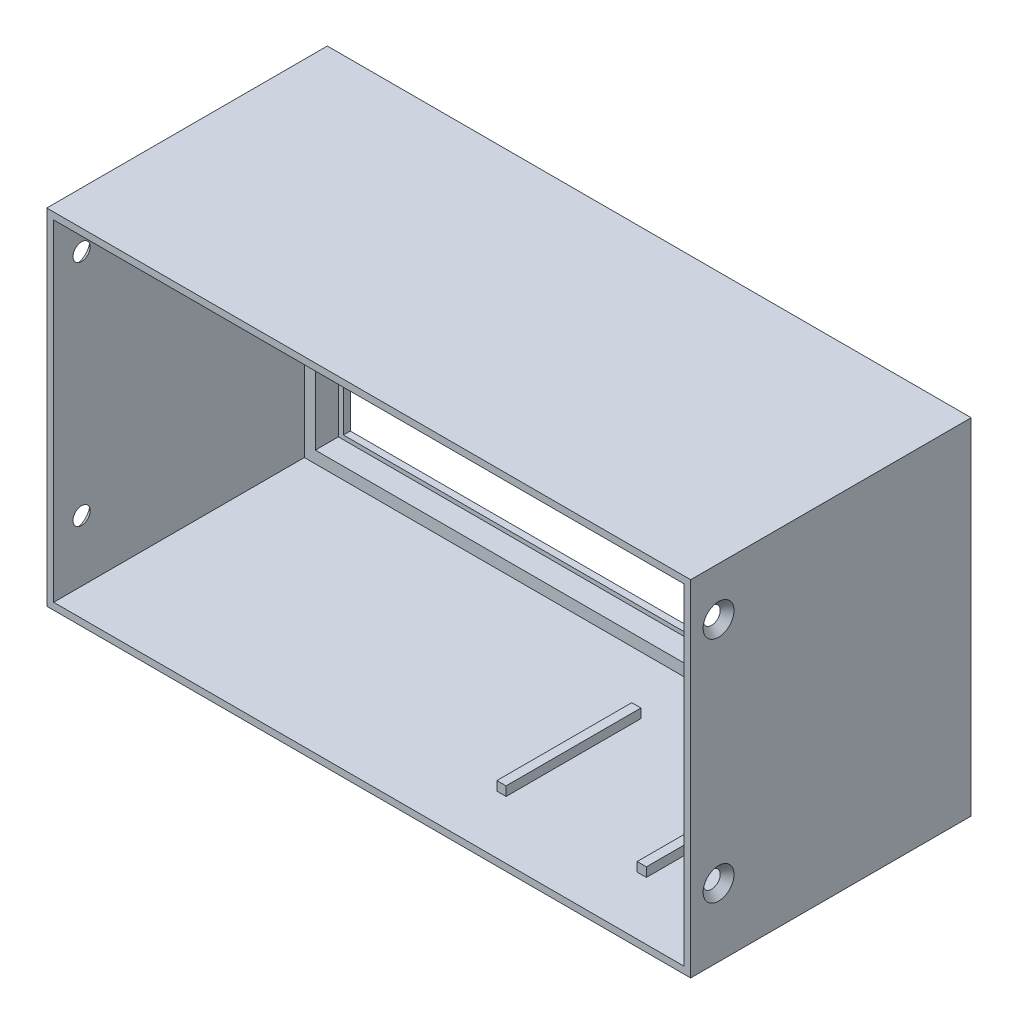
ISO-10303-21;
HEADER;
FILE_DESCRIPTION(('STEP AP214'),'2;1');
FILE_NAME('part.step','',(''),(''),'','','');
FILE_SCHEMA(('AUTOMOTIVE_DESIGN { 1 0 10303 214 1 1 1 1 }'));
ENDSEC;
DATA;
#1=APPLICATION_CONTEXT('core data for automotive mechanical design processes');
#2=APPLICATION_PROTOCOL_DEFINITION('international standard','automotive_design',2000,#1);
#3=PRODUCT_CONTEXT('',#1,'mechanical');
#4=PRODUCT('Part','Part','',(#3));
#5=PRODUCT_RELATED_PRODUCT_CATEGORY('part','',(#4));
#6=PRODUCT_DEFINITION_FORMATION('','',#4);
#7=PRODUCT_DEFINITION_CONTEXT('part definition',#1,'design');
#8=PRODUCT_DEFINITION('design','',#6,#7);
#9=PRODUCT_DEFINITION_SHAPE('','',#8);
#10=(LENGTH_UNIT() NAMED_UNIT(*) SI_UNIT(.MILLI.,.METRE.));
#11=(NAMED_UNIT(*) PLANE_ANGLE_UNIT() SI_UNIT($,.RADIAN.));
#12=(NAMED_UNIT(*) SI_UNIT($,.STERADIAN.) SOLID_ANGLE_UNIT());
#13=UNCERTAINTY_MEASURE_WITH_UNIT(LENGTH_MEASURE(1.E-05),#10,'distance_accuracy_value','');
#14=(GEOMETRIC_REPRESENTATION_CONTEXT(3) GLOBAL_UNCERTAINTY_ASSIGNED_CONTEXT((#13)) GLOBAL_UNIT_ASSIGNED_CONTEXT((#10,
#11,#12)) REPRESENTATION_CONTEXT('',''));
#15=CARTESIAN_POINT('',(0.,0.,0.));
#16=DIRECTION('',(0.,0.,1.));
#17=DIRECTION('',(1.,0.,0.));
#18=AXIS2_PLACEMENT_3D('',#15,#16,#17);
#19=CARTESIAN_POINT('',(-50.7518115942029,-41.4121376811594,61.));
#20=DIRECTION('',(0.,1.,0.));
#21=DIRECTION('',(0.,0.,1.));
#22=AXIS2_PLACEMENT_3D('',#19,#20,#21);
#23=PLANE('',#22);
#24=DIRECTION('',(0.,0.,-1.));
#25=VECTOR('',#24,1.);
#26=CARTESIAN_POINT('',(87.7481884057971,-41.4121376811594,61.));
#27=LINE('',#26,#25);
#28=CARTESIAN_POINT('',(87.7481884057971,-41.4121376811594,61.));
#29=VERTEX_POINT('',#28);
#30=CARTESIAN_POINT('',(87.7481884057971,-41.4121376811594,6.5));
#31=VERTEX_POINT('',#30);
#32=EDGE_CURVE('E348',#29,#31,#27,.T.);
#33=ORIENTED_EDGE('',*,*,#32,.T.);
#34=DIRECTION('',(1.,0.,0.));
#35=VECTOR('',#34,1.);
#36=CARTESIAN_POINT('',(-49.2518115942029,-41.4121376811594,6.5));
#37=LINE('',#36,#35);
#38=CARTESIAN_POINT('',(-49.2518115942029,-41.4121376811594,6.5));
#39=VERTEX_POINT('',#38);
#40=EDGE_CURVE('E316',#39,#31,#37,.T.);
#41=ORIENTED_EDGE('',*,*,#40,.F.);
#42=DIRECTION('',(0.,0.,-1.));
#43=VECTOR('',#42,1.);
#44=CARTESIAN_POINT('',(-49.2518115942029,-41.4121376811594,61.));
#45=LINE('',#44,#43);
#46=CARTESIAN_POINT('',(-49.2518115942029,-41.4121376811594,61.));
#47=VERTEX_POINT('',#46);
#48=EDGE_CURVE('E344',#47,#39,#45,.T.);
#49=ORIENTED_EDGE('',*,*,#48,.F.);
#50=DIRECTION('',(1.,0.,0.));
#51=VECTOR('',#50,1.);
#52=CARTESIAN_POINT('',(-50.7518115942029,-41.4121376811594,61.));
#53=LINE('',#52,#51);
#54=EDGE_CURVE('E359',#47,#29,#53,.T.);
#55=ORIENTED_EDGE('',*,*,#54,.T.);
#56=EDGE_LOOP('',(#33,#41,#49,#55));
#57=FACE_BOUND('',#56,.T.);
#58=DIRECTION('',(1.,0.,0.));
#59=VECTOR('',#58,1.);
#60=CARTESIAN_POINT('',(0.,-41.4121376811594,48.3824443702474));
#61=LINE('',#60,#59);
#62=CARTESIAN_POINT('',(34.5,-41.4121376811594,48.3824443702474));
#63=VERTEX_POINT('',#62);
#64=CARTESIAN_POINT('',(36.5,-41.4121376811594,48.3824443702474));
#65=VERTEX_POINT('',#64);
#66=EDGE_CURVE('E226',#63,#65,#61,.T.);
#67=ORIENTED_EDGE('',*,*,#66,.F.);
#68=DIRECTION('',(0.,0.,1.));
#69=VECTOR('',#68,1.);
#70=CARTESIAN_POINT('',(34.5,-41.4121376811594,0.));
#71=LINE('',#70,#69);
#72=CARTESIAN_POINT('',(34.5,-41.4121376811594,19.0628968793476));
#73=VERTEX_POINT('',#72);
#74=EDGE_CURVE('E223',#73,#63,#71,.T.);
#75=ORIENTED_EDGE('',*,*,#74,.F.);
#76=DIRECTION('',(1.,0.,0.));
#77=VECTOR('',#76,1.);
#78=CARTESIAN_POINT('',(0.,-41.4121376811594,19.0628968793476));
#79=LINE('',#78,#77);
#80=CARTESIAN_POINT('',(36.5,-41.4121376811594,19.0628968793476));
#81=VERTEX_POINT('',#80);
#82=EDGE_CURVE('E236',#73,#81,#79,.T.);
#83=ORIENTED_EDGE('',*,*,#82,.T.);
#84=DIRECTION('',(0.,0.,1.));
#85=VECTOR('',#84,1.);
#86=CARTESIAN_POINT('',(36.5,-41.4121376811594,0.));
#87=LINE('',#86,#85);
#88=EDGE_CURVE('E247',#81,#65,#87,.T.);
#89=ORIENTED_EDGE('',*,*,#88,.T.);
#90=EDGE_LOOP('',(#67,#75,#83,#89));
#91=FACE_BOUND('',#90,.T.);
#92=DIRECTION('',(1.,0.,0.));
#93=VECTOR('',#92,1.);
#94=CARTESIAN_POINT('',(0.,-41.4121376811594,48.3824443702474));
#95=LINE('',#94,#93);
#96=CARTESIAN_POINT('',(65.,-41.4121376811594,48.3824443702474));
#97=VERTEX_POINT('',#96);
#98=CARTESIAN_POINT('',(67.,-41.4121376811594,48.3824443702474));
#99=VERTEX_POINT('',#98);
#100=EDGE_CURVE('E56',#97,#99,#95,.T.);
#101=ORIENTED_EDGE('',*,*,#100,.F.);
#102=DIRECTION('',(0.,0.,1.));
#103=VECTOR('',#102,1.);
#104=CARTESIAN_POINT('',(65.,-41.4121376811594,0.));
#105=LINE('',#104,#103);
#106=CARTESIAN_POINT('',(65.,-41.4121376811594,19.0628968793476));
#107=VERTEX_POINT('',#106);
#108=EDGE_CURVE('E222',#107,#97,#105,.T.);
#109=ORIENTED_EDGE('',*,*,#108,.F.);
#110=DIRECTION('',(1.,0.,0.));
#111=VECTOR('',#110,1.);
#112=CARTESIAN_POINT('',(0.,-41.4121376811594,19.0628968793476));
#113=LINE('',#112,#111);
#114=CARTESIAN_POINT('',(67.,-41.4121376811594,19.0628968793476));
#115=VERTEX_POINT('',#114);
#116=EDGE_CURVE('E219',#107,#115,#113,.T.);
#117=ORIENTED_EDGE('',*,*,#116,.T.);
#118=DIRECTION('',(0.,0.,1.));
#119=VECTOR('',#118,1.);
#120=CARTESIAN_POINT('',(67.,-41.4121376811594,0.));
#121=LINE('',#120,#119);
#122=EDGE_CURVE('E61',#115,#99,#121,.T.);
#123=ORIENTED_EDGE('',*,*,#122,.T.);
#124=EDGE_LOOP('',(#101,#109,#117,#123));
#125=FACE_BOUND('',#124,.T.);
#126=ADVANCED_FACE('F41',(#57,#91,#125),#23,.T.);
#127=CARTESIAN_POINT('',(0.,0.,1.5));
#128=DIRECTION('',(0.,0.,1.));
#129=DIRECTION('',(1.,0.,0.));
#130=AXIS2_PLACEMENT_3D('',#127,#128,#129);
#131=PLANE('',#130);
#132=DIRECTION('',(0.,1.,0.));
#133=VECTOR('',#132,1.);
#134=CARTESIAN_POINT('',(84.2481884057971,0.,1.5));
#135=LINE('',#134,#133);
#136=CARTESIAN_POINT('',(84.2481884057971,-37.9121376811594,1.50000000000002));
#137=VERTEX_POINT('',#136);
#138=CARTESIAN_POINT('',(84.2481884057971,27.0878623188406,1.50000000000002));
#139=VERTEX_POINT('',#138);
#140=EDGE_CURVE('E11',#137,#139,#135,.T.);
#141=ORIENTED_EDGE('',*,*,#140,.F.);
#142=DIRECTION('',(1.,0.,0.));
#143=VECTOR('',#142,1.);
#144=CARTESIAN_POINT('',(0.,-37.9121376811594,1.5));
#145=LINE('',#144,#143);
#146=CARTESIAN_POINT('',(-45.7518115942029,-37.9121376811594,1.5));
#147=VERTEX_POINT('',#146);
#148=EDGE_CURVE('E394',#147,#137,#145,.T.);
#149=ORIENTED_EDGE('',*,*,#148,.F.);
#150=DIRECTION('',(0.,-1.,0.));
#151=VECTOR('',#150,1.);
#152=CARTESIAN_POINT('',(-45.7518115942029,0.,1.5));
#153=LINE('',#152,#151);
#154=CARTESIAN_POINT('',(-45.7518115942029,27.0878623188406,1.50000000000002));
#155=VERTEX_POINT('',#154);
#156=EDGE_CURVE('E396',#155,#147,#153,.T.);
#157=ORIENTED_EDGE('',*,*,#156,.F.);
#158=DIRECTION('',(-1.,0.,0.));
#159=VECTOR('',#158,1.);
#160=CARTESIAN_POINT('',(0.,27.0878623188406,1.5));
#161=LINE('',#160,#159);
#162=EDGE_CURVE('E49',#139,#155,#161,.T.);
#163=ORIENTED_EDGE('',*,*,#162,.F.);
#164=EDGE_LOOP('',(#141,#149,#157,#163));
#165=FACE_BOUND('',#164,.T.);
#166=DIRECTION('',(-1.,0.,0.));
#167=VECTOR('',#166,1.);
#168=CARTESIAN_POINT('',(-49.2518115942029,-38.8121376811594,1.5));
#169=LINE('',#168,#167);
#170=CARTESIAN_POINT('',(85.3481884057971,-38.8121376811594,1.5));
#171=VERTEX_POINT('',#170);
#172=CARTESIAN_POINT('',(-46.8518115942029,-38.8121376811594,1.5));
#173=VERTEX_POINT('',#172);
#174=EDGE_CURVE('E309',#171,#173,#169,.T.);
#175=ORIENTED_EDGE('',*,*,#174,.F.);
#176=DIRECTION('',(0.,-1.,0.));
#177=VECTOR('',#176,1.);
#178=CARTESIAN_POINT('',(85.3481884057971,30.5878623188406,1.5));
#179=LINE('',#178,#177);
#180=CARTESIAN_POINT('',(85.3481884057971,27.2878623188406,1.5));
#181=VERTEX_POINT('',#180);
#182=EDGE_CURVE('E289',#181,#171,#179,.T.);
#183=ORIENTED_EDGE('',*,*,#182,.F.);
#184=DIRECTION('',(1.,0.,0.));
#185=VECTOR('',#184,1.);
#186=CARTESIAN_POINT('',(-49.2518115942029,27.2878623188406,1.5));
#187=LINE('',#186,#185);
#188=CARTESIAN_POINT('',(-46.8518115942029,27.2878623188406,1.5));
#189=VERTEX_POINT('',#188);
#190=EDGE_CURVE('E306',#189,#181,#187,.T.);
#191=ORIENTED_EDGE('',*,*,#190,.F.);
#192=DIRECTION('',(0.,1.,0.));
#193=VECTOR('',#192,1.);
#194=CARTESIAN_POINT('',(-46.8518115942029,30.5878623188406,1.5));
#195=LINE('',#194,#193);
#196=EDGE_CURVE('E295',#173,#189,#195,.T.);
#197=ORIENTED_EDGE('',*,*,#196,.F.);
#198=EDGE_LOOP('',(#175,#183,#191,#197));
#199=FACE_BOUND('',#198,.T.);
#200=ADVANCED_FACE('F411',(#165,#199),#131,.T.);
#201=CARTESIAN_POINT('',(-49.2518115942029,-38.8121376811594,6.5));
#202=DIRECTION('',(0.,-1.,0.));
#203=DIRECTION('',(0.,0.,-1.));
#204=AXIS2_PLACEMENT_3D('',#201,#202,#203);
#205=PLANE('',#204);
#206=DIRECTION('',(0.,0.,-1.));
#207=VECTOR('',#206,1.);
#208=CARTESIAN_POINT('',(85.3481884057971,-38.8121376811594,6.5));
#209=LINE('',#208,#207);
#210=CARTESIAN_POINT('',(85.3481884057971,-38.8121376811594,6.5));
#211=VERTEX_POINT('',#210);
#212=EDGE_CURVE('E285',#211,#171,#209,.T.);
#213=ORIENTED_EDGE('',*,*,#212,.T.);
#214=ORIENTED_EDGE('',*,*,#174,.T.);
#215=DIRECTION('',(0.,0.,-1.));
#216=VECTOR('',#215,1.);
#217=CARTESIAN_POINT('',(-46.8518115942029,-38.8121376811594,6.5));
#218=LINE('',#217,#216);
#219=CARTESIAN_POINT('',(-46.8518115942029,-38.8121376811594,6.5));
#220=VERTEX_POINT('',#219);
#221=EDGE_CURVE('E298',#220,#173,#218,.T.);
#222=ORIENTED_EDGE('',*,*,#221,.F.);
#223=DIRECTION('',(-1.,0.,0.));
#224=VECTOR('',#223,1.);
#225=CARTESIAN_POINT('',(-49.2518115942029,-38.8121376811594,6.5));
#226=LINE('',#225,#224);
#227=EDGE_CURVE('E320',#211,#220,#226,.T.);
#228=ORIENTED_EDGE('',*,*,#227,.F.);
#229=EDGE_LOOP('',(#213,#214,#222,#228));
#230=FACE_BOUND('',#229,.T.);
#231=ADVANCED_FACE('F459',(#230),#205,.F.);
#232=CARTESIAN_POINT('',(-49.2518115942029,27.2878623188406,6.5));
#233=DIRECTION('',(0.,1.,0.));
#234=DIRECTION('',(0.,0.,1.));
#235=AXIS2_PLACEMENT_3D('',#232,#233,#234);
#236=PLANE('',#235);
#237=DIRECTION('',(0.,0.,-1.));
#238=VECTOR('',#237,1.);
#239=CARTESIAN_POINT('',(85.3481884057971,27.2878623188406,6.5));
#240=LINE('',#239,#238);
#241=CARTESIAN_POINT('',(85.3481884057971,27.2878623188406,6.5));
#242=VERTEX_POINT('',#241);
#243=EDGE_CURVE('E291',#242,#181,#240,.T.);
#244=ORIENTED_EDGE('',*,*,#243,.F.);
#245=DIRECTION('',(1.,0.,0.));
#246=VECTOR('',#245,1.);
#247=CARTESIAN_POINT('',(-49.2518115942029,27.2878623188406,6.5));
#248=LINE('',#247,#246);
#249=CARTESIAN_POINT('',(-46.8518115942029,27.2878623188406,6.5));
#250=VERTEX_POINT('',#249);
#251=EDGE_CURVE('E310',#250,#242,#248,.T.);
#252=ORIENTED_EDGE('',*,*,#251,.F.);
#253=DIRECTION('',(0.,0.,1.));
#254=VECTOR('',#253,1.);
#255=CARTESIAN_POINT('',(-46.8518115942029,27.2878623188406,6.5));
#256=LINE('',#255,#254);
#257=EDGE_CURVE('E302',#189,#250,#256,.T.);
#258=ORIENTED_EDGE('',*,*,#257,.F.);
#259=ORIENTED_EDGE('',*,*,#190,.T.);
#260=EDGE_LOOP('',(#244,#252,#258,#259));
#261=FACE_BOUND('',#260,.T.);
#262=ADVANCED_FACE('F468',(#261),#236,.F.);
#263=CARTESIAN_POINT('',(87.7481884057971,32.0878623188406,61.));
#264=DIRECTION('',(-1.,0.,0.));
#265=DIRECTION('',(0.,0.,1.));
#266=AXIS2_PLACEMENT_3D('',#263,#264,#265);
#267=PLANE('',#266);
#268=CARTESIAN_POINT('',(87.7481884057971,21.5834632247753,54.9346766490614));
#269=DIRECTION('',(-1.,0.,0.));
#270=DIRECTION('',(0.,0.,1.));
#271=AXIS2_PLACEMENT_3D('',#268,#269,#270);
#272=CIRCLE('',#271,1.86000000000001);
#273=CARTESIAN_POINT('',(87.7481884057971,21.5834632247753,56.7946766490614));
#274=VERTEX_POINT('',#273);
#275=EDGE_CURVE('E264',#274,#274,#272,.T.);
#276=ORIENTED_EDGE('',*,*,#275,.F.);
#277=EDGE_LOOP('',(#276));
#278=FACE_BOUND('',#277,.T.);
#279=CARTESIAN_POINT('',(87.7481884057971,-28.1183196175336,54.9346766490614));
#280=DIRECTION('',(-1.,0.,0.));
#281=DIRECTION('',(0.,0.,1.));
#282=AXIS2_PLACEMENT_3D('',#279,#280,#281);
#283=CIRCLE('',#282,1.86000000000001);
#284=CARTESIAN_POINT('',(87.7481884057971,-28.1183196175336,56.7946766490614));
#285=VERTEX_POINT('',#284);
#286=EDGE_CURVE('E270',#285,#285,#283,.T.);
#287=ORIENTED_EDGE('',*,*,#286,.F.);
#288=EDGE_LOOP('',(#287));
#289=FACE_BOUND('',#288,.T.);
#290=DIRECTION('',(0.,0.,-1.));
#291=VECTOR('',#290,1.);
#292=CARTESIAN_POINT('',(87.7481884057971,30.5878623188406,61.));
#293=LINE('',#292,#291);
#294=CARTESIAN_POINT('',(87.7481884057971,30.5878623188406,61.));
#295=VERTEX_POINT('',#294);
#296=CARTESIAN_POINT('',(87.7481884057971,30.5878623188406,6.5));
#297=VERTEX_POINT('',#296);
#298=EDGE_CURVE('E352',#295,#297,#293,.T.);
#299=ORIENTED_EDGE('',*,*,#298,.T.);
#300=DIRECTION('',(0.,1.,0.));
#301=VECTOR('',#300,1.);
#302=CARTESIAN_POINT('',(87.7481884057971,-41.4121376811594,6.5));
#303=LINE('',#302,#301);
#304=EDGE_CURVE('E318',#31,#297,#303,.T.);
#305=ORIENTED_EDGE('',*,*,#304,.F.);
#306=ORIENTED_EDGE('',*,*,#32,.F.);
#307=DIRECTION('',(0.,1.,0.));
#308=VECTOR('',#307,1.);
#309=CARTESIAN_POINT('',(87.7481884057971,32.0878623188406,61.));
#310=LINE('',#309,#308);
#311=EDGE_CURVE('E361',#29,#295,#310,.T.);
#312=ORIENTED_EDGE('',*,*,#311,.T.);
#313=EDGE_LOOP('',(#299,#305,#306,#312));
#314=FACE_BOUND('',#313,.T.);
#315=ADVANCED_FACE('F465',(#278,#289,#314),#267,.T.);
#316=CARTESIAN_POINT('',(-49.2518115942029,32.0878623188406,61.));
#317=DIRECTION('',(1.,0.,0.));
#318=DIRECTION('',(0.,1.,0.));
#319=AXIS2_PLACEMENT_3D('',#316,#317,#318);
#320=PLANE('',#319);
#321=CARTESIAN_POINT('',(-49.2518115942029,21.5834632247753,54.9346766490614));
#322=DIRECTION('',(1.,0.,0.));
#323=DIRECTION('',(0.,1.,0.));
#324=AXIS2_PLACEMENT_3D('',#321,#322,#323);
#325=CIRCLE('',#324,1.86);
#326=CARTESIAN_POINT('',(-49.2518115942029,23.4434632247753,54.9346766490614));
#327=VERTEX_POINT('',#326);
#328=EDGE_CURVE('E276',#327,#327,#325,.T.);
#329=ORIENTED_EDGE('',*,*,#328,.F.);
#330=EDGE_LOOP('',(#329));
#331=FACE_BOUND('',#330,.T.);
#332=CARTESIAN_POINT('',(-49.2518115942029,-28.1183196175337,54.9346766490614));
#333=DIRECTION('',(1.,0.,0.));
#334=DIRECTION('',(0.,1.,0.));
#335=AXIS2_PLACEMENT_3D('',#332,#333,#334);
#336=CIRCLE('',#335,1.85999999999999);
#337=CARTESIAN_POINT('',(-49.2518115942029,-26.2583196175337,54.9346766490614));
#338=VERTEX_POINT('',#337);
#339=EDGE_CURVE('E282',#338,#338,#336,.T.);
#340=ORIENTED_EDGE('',*,*,#339,.F.);
#341=EDGE_LOOP('',(#340));
#342=FACE_BOUND('',#341,.T.);
#343=DIRECTION('',(0.,-1.,0.));
#344=VECTOR('',#343,1.);
#345=CARTESIAN_POINT('',(-49.2518115942029,-41.4121376811594,6.5));
#346=LINE('',#345,#344);
#347=CARTESIAN_POINT('',(-49.2518115942029,30.5878623188406,6.5));
#348=VERTEX_POINT('',#347);
#349=EDGE_CURVE('E314',#348,#39,#346,.T.);
#350=ORIENTED_EDGE('',*,*,#349,.F.);
#351=DIRECTION('',(0.,0.,-1.));
#352=VECTOR('',#351,1.);
#353=CARTESIAN_POINT('',(-49.2518115942029,30.5878623188406,61.));
#354=LINE('',#353,#352);
#355=CARTESIAN_POINT('',(-49.2518115942029,30.5878623188406,61.));
#356=VERTEX_POINT('',#355);
#357=EDGE_CURVE('E349',#356,#348,#354,.T.);
#358=ORIENTED_EDGE('',*,*,#357,.F.);
#359=DIRECTION('',(0.,-1.,0.));
#360=VECTOR('',#359,1.);
#361=CARTESIAN_POINT('',(-49.2518115942029,32.0878623188406,61.));
#362=LINE('',#361,#360);
#363=EDGE_CURVE('E337',#356,#47,#362,.T.);
#364=ORIENTED_EDGE('',*,*,#363,.T.);
#365=ORIENTED_EDGE('',*,*,#48,.T.);
#366=EDGE_LOOP('',(#350,#358,#364,#365));
#367=FACE_BOUND('',#366,.T.);
#368=ADVANCED_FACE('F463',(#331,#342,#367),#320,.T.);
#369=CARTESIAN_POINT('',(-50.7518115942029,30.5878623188406,61.));
#370=DIRECTION('',(0.,-1.,0.));
#371=DIRECTION('',(0.,0.,-1.));
#372=AXIS2_PLACEMENT_3D('',#369,#370,#371);
#373=PLANE('',#372);
#374=ORIENTED_EDGE('',*,*,#357,.T.);
#375=DIRECTION('',(-1.,0.,0.));
#376=VECTOR('',#375,1.);
#377=CARTESIAN_POINT('',(-49.2518115942029,30.5878623188406,6.5));
#378=LINE('',#377,#376);
#379=EDGE_CURVE('E305',#297,#348,#378,.T.);
#380=ORIENTED_EDGE('',*,*,#379,.F.);
#381=ORIENTED_EDGE('',*,*,#298,.F.);
#382=DIRECTION('',(-1.,0.,0.));
#383=VECTOR('',#382,1.);
#384=CARTESIAN_POINT('',(-50.7518115942029,30.5878623188406,61.));
#385=LINE('',#384,#383);
#386=EDGE_CURVE('E353',#295,#356,#385,.T.);
#387=ORIENTED_EDGE('',*,*,#386,.T.);
#388=EDGE_LOOP('',(#374,#380,#381,#387));
#389=FACE_BOUND('',#388,.T.);
#390=ADVANCED_FACE('F470',(#389),#373,.T.);
#391=CARTESIAN_POINT('',(-50.7518115942029,32.0878623188406,61.));
#392=DIRECTION('',(1.,0.,0.));
#393=DIRECTION('',(0.,1.,0.));
#394=AXIS2_PLACEMENT_3D('',#391,#392,#393);
#395=PLANE('',#394);
#396=CARTESIAN_POINT('',(-50.7518115942029,21.5834632247753,54.9346766490614));
#397=DIRECTION('',(-1.,0.,0.));
#398=DIRECTION('',(0.,0.,1.));
#399=AXIS2_PLACEMENT_3D('',#396,#397,#398);
#400=CIRCLE('',#399,3.36);
#401=CARTESIAN_POINT('',(-50.7518115942029,21.5834632247753,58.2946766490614));
#402=VERTEX_POINT('',#401);
#403=EDGE_CURVE('E273',#402,#402,#400,.T.);
#404=ORIENTED_EDGE('',*,*,#403,.F.);
#405=EDGE_LOOP('',(#404));
#406=FACE_BOUND('',#405,.T.);
#407=CARTESIAN_POINT('',(-50.7518115942029,-28.1183196175337,54.9346766490614));
#408=DIRECTION('',(-1.,0.,0.));
#409=DIRECTION('',(0.,0.,1.));
#410=AXIS2_PLACEMENT_3D('',#407,#408,#409);
#411=CIRCLE('',#410,3.36);
#412=CARTESIAN_POINT('',(-50.7518115942029,-28.1183196175337,58.2946766490614));
#413=VERTEX_POINT('',#412);
#414=EDGE_CURVE('E279',#413,#413,#411,.T.);
#415=ORIENTED_EDGE('',*,*,#414,.F.);
#416=EDGE_LOOP('',(#415));
#417=FACE_BOUND('',#416,.T.);
#418=DIRECTION('',(0.,-1.,0.));
#419=VECTOR('',#418,1.);
#420=CARTESIAN_POINT('',(-50.7518115942029,32.0878623188406,0.));
#421=LINE('',#420,#419);
#422=CARTESIAN_POINT('',(-50.7518115942029,32.0878623188406,0.));
#423=VERTEX_POINT('',#422);
#424=CARTESIAN_POINT('',(-50.7518115942029,-42.9121376811594,0.));
#425=VERTEX_POINT('',#424);
#426=EDGE_CURVE('E347',#423,#425,#421,.T.);
#427=ORIENTED_EDGE('',*,*,#426,.T.);
#428=DIRECTION('',(0.,0.,-1.));
#429=VECTOR('',#428,1.);
#430=CARTESIAN_POINT('',(-50.7518115942029,-42.9121376811594,61.));
#431=LINE('',#430,#429);
#432=CARTESIAN_POINT('',(-50.7518115942029,-42.9121376811594,61.));
#433=VERTEX_POINT('',#432);
#434=EDGE_CURVE('E391',#433,#425,#431,.T.);
#435=ORIENTED_EDGE('',*,*,#434,.F.);
#436=DIRECTION('',(0.,-1.,0.));
#437=VECTOR('',#436,1.);
#438=CARTESIAN_POINT('',(-50.7518115942029,32.0878623188406,61.));
#439=LINE('',#438,#437);
#440=CARTESIAN_POINT('',(-50.7518115942029,32.0878623188406,61.));
#441=VERTEX_POINT('',#440);
#442=EDGE_CURVE('E365',#441,#433,#439,.T.);
#443=ORIENTED_EDGE('',*,*,#442,.F.);
#444=DIRECTION('',(0.,0.,-1.));
#445=VECTOR('',#444,1.);
#446=CARTESIAN_POINT('',(-50.7518115942029,32.0878623188406,61.));
#447=LINE('',#446,#445);
#448=EDGE_CURVE('E375',#441,#423,#447,.T.);
#449=ORIENTED_EDGE('',*,*,#448,.T.);
#450=EDGE_LOOP('',(#427,#435,#443,#449));
#451=FACE_BOUND('',#450,.T.);
#452=ADVANCED_FACE('F43',(#406,#417,#451),#395,.F.);
#453=CARTESIAN_POINT('',(-50.7518115942029,-42.9121376811594,61.));
#454=DIRECTION('',(0.,1.,0.));
#455=DIRECTION('',(0.,0.,1.));
#456=AXIS2_PLACEMENT_3D('',#453,#454,#455);
#457=PLANE('',#456);
#458=DIRECTION('',(1.,0.,0.));
#459=VECTOR('',#458,1.);
#460=CARTESIAN_POINT('',(-50.7518115942029,-42.9121376811594,0.));
#461=LINE('',#460,#459);
#462=CARTESIAN_POINT('',(89.2481884057971,-42.9121376811594,0.));
#463=VERTEX_POINT('',#462);
#464=EDGE_CURVE('E378',#425,#463,#461,.T.);
#465=ORIENTED_EDGE('',*,*,#464,.T.);
#466=DIRECTION('',(0.,0.,-1.));
#467=VECTOR('',#466,1.);
#468=CARTESIAN_POINT('',(89.2481884057971,-42.9121376811594,61.));
#469=LINE('',#468,#467);
#470=CARTESIAN_POINT('',(89.2481884057971,-42.9121376811594,61.));
#471=VERTEX_POINT('',#470);
#472=EDGE_CURVE('E388',#471,#463,#469,.T.);
#473=ORIENTED_EDGE('',*,*,#472,.F.);
#474=DIRECTION('',(1.,0.,0.));
#475=VECTOR('',#474,1.);
#476=CARTESIAN_POINT('',(-50.7518115942029,-42.9121376811594,61.));
#477=LINE('',#476,#475);
#478=EDGE_CURVE('E368',#433,#471,#477,.T.);
#479=ORIENTED_EDGE('',*,*,#478,.F.);
#480=ORIENTED_EDGE('',*,*,#434,.T.);
#481=EDGE_LOOP('',(#465,#473,#479,#480));
#482=FACE_BOUND('',#481,.T.);
#483=ADVANCED_FACE('F442',(#482),#457,.F.);
#484=CARTESIAN_POINT('',(89.2481884057971,32.0878623188406,61.));
#485=DIRECTION('',(-1.,0.,0.));
#486=DIRECTION('',(0.,0.,1.));
#487=AXIS2_PLACEMENT_3D('',#484,#485,#486);
#488=PLANE('',#487);
#489=CARTESIAN_POINT('',(89.2481884057971,21.5834632247753,54.9346766490614));
#490=DIRECTION('',(1.,0.,0.));
#491=DIRECTION('',(0.,0.,-1.));
#492=AXIS2_PLACEMENT_3D('',#489,#490,#491);
#493=CIRCLE('',#492,3.36);
#494=CARTESIAN_POINT('',(89.2481884057971,21.5834632247753,51.5746766490614));
#495=VERTEX_POINT('',#494);
#496=EDGE_CURVE('E261',#495,#495,#493,.T.);
#497=ORIENTED_EDGE('',*,*,#496,.F.);
#498=EDGE_LOOP('',(#497));
#499=FACE_BOUND('',#498,.T.);
#500=CARTESIAN_POINT('',(89.2481884057971,-28.1183196175336,54.9346766490614));
#501=DIRECTION('',(1.,0.,0.));
#502=DIRECTION('',(0.,0.,-1.));
#503=AXIS2_PLACEMENT_3D('',#500,#501,#502);
#504=CIRCLE('',#503,3.36);
#505=CARTESIAN_POINT('',(89.2481884057971,-28.1183196175336,51.5746766490614));
#506=VERTEX_POINT('',#505);
#507=EDGE_CURVE('E267',#506,#506,#504,.T.);
#508=ORIENTED_EDGE('',*,*,#507,.F.);
#509=EDGE_LOOP('',(#508));
#510=FACE_BOUND('',#509,.T.);
#511=DIRECTION('',(0.,1.,0.));
#512=VECTOR('',#511,1.);
#513=CARTESIAN_POINT('',(89.2481884057971,32.0878623188406,0.));
#514=LINE('',#513,#512);
#515=CARTESIAN_POINT('',(89.2481884057971,32.0878623188406,0.));
#516=VERTEX_POINT('',#515);
#517=EDGE_CURVE('E380',#463,#516,#514,.T.);
#518=ORIENTED_EDGE('',*,*,#517,.T.);
#519=DIRECTION('',(0.,0.,-1.));
#520=VECTOR('',#519,1.);
#521=CARTESIAN_POINT('',(89.2481884057971,32.0878623188406,61.));
#522=LINE('',#521,#520);
#523=CARTESIAN_POINT('',(89.2481884057971,32.0878623188406,61.));
#524=VERTEX_POINT('',#523);
#525=EDGE_CURVE('E385',#524,#516,#522,.T.);
#526=ORIENTED_EDGE('',*,*,#525,.F.);
#527=DIRECTION('',(0.,1.,0.));
#528=VECTOR('',#527,1.);
#529=CARTESIAN_POINT('',(89.2481884057971,32.0878623188406,61.));
#530=LINE('',#529,#528);
#531=EDGE_CURVE('E371',#471,#524,#530,.T.);
#532=ORIENTED_EDGE('',*,*,#531,.F.);
#533=ORIENTED_EDGE('',*,*,#472,.T.);
#534=EDGE_LOOP('',(#518,#526,#532,#533));
#535=FACE_BOUND('',#534,.T.);
#536=ADVANCED_FACE('F439',(#499,#510,#535),#488,.F.);
#537=CARTESIAN_POINT('',(-50.7518115942029,32.0878623188406,61.));
#538=DIRECTION('',(0.,-1.,0.));
#539=DIRECTION('',(0.,0.,-1.));
#540=AXIS2_PLACEMENT_3D('',#537,#538,#539);
#541=PLANE('',#540);
#542=DIRECTION('',(-1.,0.,0.));
#543=VECTOR('',#542,1.);
#544=CARTESIAN_POINT('',(-50.7518115942029,32.0878623188406,0.));
#545=LINE('',#544,#543);
#546=EDGE_CURVE('E369',#516,#423,#545,.T.);
#547=ORIENTED_EDGE('',*,*,#546,.T.);
#548=ORIENTED_EDGE('',*,*,#448,.F.);
#549=DIRECTION('',(-1.,0.,0.));
#550=VECTOR('',#549,1.);
#551=CARTESIAN_POINT('',(-50.7518115942029,32.0878623188406,61.));
#552=LINE('',#551,#550);
#553=EDGE_CURVE('E373',#524,#441,#552,.T.);
#554=ORIENTED_EDGE('',*,*,#553,.F.);
#555=ORIENTED_EDGE('',*,*,#525,.T.);
#556=EDGE_LOOP('',(#547,#548,#554,#555));
#557=FACE_BOUND('',#556,.T.);
#558=ADVANCED_FACE('F435',(#557),#541,.F.);
#559=CARTESIAN_POINT('',(0.,0.,61.));
#560=DIRECTION('',(0.,0.,1.));
#561=DIRECTION('',(1.,0.,0.));
#562=AXIS2_PLACEMENT_3D('',#559,#560,#561);
#563=PLANE('',#562);
#564=ORIENTED_EDGE('',*,*,#363,.F.);
#565=ORIENTED_EDGE('',*,*,#386,.F.);
#566=ORIENTED_EDGE('',*,*,#311,.F.);
#567=ORIENTED_EDGE('',*,*,#54,.F.);
#568=EDGE_LOOP('',(#564,#565,#566,#567));
#569=FACE_BOUND('',#568,.T.);
#570=ORIENTED_EDGE('',*,*,#442,.T.);
#571=ORIENTED_EDGE('',*,*,#478,.T.);
#572=ORIENTED_EDGE('',*,*,#531,.T.);
#573=ORIENTED_EDGE('',*,*,#553,.T.);
#574=EDGE_LOOP('',(#570,#571,#572,#573));
#575=FACE_BOUND('',#574,.T.);
#576=ADVANCED_FACE('F424',(#569,#575),#563,.T.);
#577=CARTESIAN_POINT('',(0.,0.,0.));
#578=DIRECTION('',(0.,0.,1.));
#579=DIRECTION('',(1.,0.,0.));
#580=AXIS2_PLACEMENT_3D('',#577,#578,#579);
#581=PLANE('',#580);
#582=DIRECTION('',(-1.,0.,0.));
#583=VECTOR('',#582,1.);
#584=CARTESIAN_POINT('',(84.2481884057971,-37.9121376811594,0.));
#585=LINE('',#584,#583);
#586=CARTESIAN_POINT('',(84.2481884057971,-37.9121376811594,0.));
#587=VERTEX_POINT('',#586);
#588=CARTESIAN_POINT('',(-45.7518115942029,-37.9121376811594,0.));
#589=VERTEX_POINT('',#588);
#590=EDGE_CURVE('E325',#587,#589,#585,.T.);
#591=ORIENTED_EDGE('',*,*,#590,.F.);
#592=DIRECTION('',(0.,-1.,0.));
#593=VECTOR('',#592,1.);
#594=CARTESIAN_POINT('',(84.2481884057971,27.0878623188406,0.));
#595=LINE('',#594,#593);
#596=CARTESIAN_POINT('',(84.2481884057971,27.0878623188406,0.));
#597=VERTEX_POINT('',#596);
#598=EDGE_CURVE('E322',#597,#587,#595,.T.);
#599=ORIENTED_EDGE('',*,*,#598,.F.);
#600=DIRECTION('',(1.,0.,0.));
#601=VECTOR('',#600,1.);
#602=CARTESIAN_POINT('',(84.2481884057971,27.0878623188406,0.));
#603=LINE('',#602,#601);
#604=CARTESIAN_POINT('',(-45.7518115942029,27.0878623188406,0.));
#605=VERTEX_POINT('',#604);
#606=EDGE_CURVE('E331',#605,#597,#603,.T.);
#607=ORIENTED_EDGE('',*,*,#606,.F.);
#608=DIRECTION('',(0.,1.,0.));
#609=VECTOR('',#608,1.);
#610=CARTESIAN_POINT('',(-45.7518115942029,27.0878623188406,0.));
#611=LINE('',#610,#609);
#612=EDGE_CURVE('E328',#589,#605,#611,.T.);
#613=ORIENTED_EDGE('',*,*,#612,.F.);
#614=EDGE_LOOP('',(#591,#599,#607,#613));
#615=FACE_BOUND('',#614,.T.);
#616=ORIENTED_EDGE('',*,*,#426,.F.);
#617=ORIENTED_EDGE('',*,*,#546,.F.);
#618=ORIENTED_EDGE('',*,*,#517,.F.);
#619=ORIENTED_EDGE('',*,*,#464,.F.);
#620=EDGE_LOOP('',(#616,#617,#618,#619));
#621=FACE_BOUND('',#620,.T.);
#622=ADVANCED_FACE('F421',(#615,#621),#581,.F.);
#623=CARTESIAN_POINT('',(84.2481884057971,27.0878623188406,61.));
#624=DIRECTION('',(1.,0.,0.));
#625=DIRECTION('',(0.,1.,0.));
#626=AXIS2_PLACEMENT_3D('',#623,#624,#625);
#627=PLANE('',#626);
#628=ORIENTED_EDGE('',*,*,#140,.T.);
#629=DIRECTION('',(0.,0.,-1.));
#630=VECTOR('',#629,1.);
#631=CARTESIAN_POINT('',(84.2481884057971,27.0878623188406,61.));
#632=LINE('',#631,#630);
#633=EDGE_CURVE('E335',#139,#597,#632,.T.);
#634=ORIENTED_EDGE('',*,*,#633,.T.);
#635=ORIENTED_EDGE('',*,*,#598,.T.);
#636=DIRECTION('',(0.,0.,-1.));
#637=VECTOR('',#636,1.);
#638=CARTESIAN_POINT('',(84.2481884057971,-37.9121376811594,61.));
#639=LINE('',#638,#637);
#640=EDGE_CURVE('E334',#137,#587,#639,.T.);
#641=ORIENTED_EDGE('',*,*,#640,.F.);
#642=EDGE_LOOP('',(#628,#634,#635,#641));
#643=FACE_BOUND('',#642,.T.);
#644=ADVANCED_FACE('F418',(#643),#627,.F.);
#645=CARTESIAN_POINT('',(84.2481884057971,27.0878623188406,61.));
#646=DIRECTION('',(0.,1.,0.));
#647=DIRECTION('',(0.,0.,1.));
#648=AXIS2_PLACEMENT_3D('',#645,#646,#647);
#649=PLANE('',#648);
#650=ORIENTED_EDGE('',*,*,#162,.T.);
#651=DIRECTION('',(0.,0.,-1.));
#652=VECTOR('',#651,1.);
#653=CARTESIAN_POINT('',(-45.7518115942029,27.0878623188406,61.));
#654=LINE('',#653,#652);
#655=EDGE_CURVE('E338',#155,#605,#654,.T.);
#656=ORIENTED_EDGE('',*,*,#655,.T.);
#657=ORIENTED_EDGE('',*,*,#606,.T.);
#658=ORIENTED_EDGE('',*,*,#633,.F.);
#659=EDGE_LOOP('',(#650,#656,#657,#658));
#660=FACE_BOUND('',#659,.T.);
#661=ADVANCED_FACE('F402',(#660),#649,.F.);
#662=CARTESIAN_POINT('',(-45.7518115942029,27.0878623188406,61.));
#663=DIRECTION('',(-1.,0.,0.));
#664=DIRECTION('',(0.,-1.,0.));
#665=AXIS2_PLACEMENT_3D('',#662,#663,#664);
#666=PLANE('',#665);
#667=ORIENTED_EDGE('',*,*,#156,.T.);
#668=DIRECTION('',(0.,0.,-1.));
#669=VECTOR('',#668,1.);
#670=CARTESIAN_POINT('',(-45.7518115942029,-37.9121376811594,61.));
#671=LINE('',#670,#669);
#672=EDGE_CURVE('E340',#147,#589,#671,.T.);
#673=ORIENTED_EDGE('',*,*,#672,.T.);
#674=ORIENTED_EDGE('',*,*,#612,.T.);
#675=ORIENTED_EDGE('',*,*,#655,.F.);
#676=EDGE_LOOP('',(#667,#673,#674,#675));
#677=FACE_BOUND('',#676,.T.);
#678=ADVANCED_FACE('F407',(#677),#666,.F.);
#679=CARTESIAN_POINT('',(84.2481884057971,-37.9121376811594,61.));
#680=DIRECTION('',(0.,-1.,0.));
#681=DIRECTION('',(0.,0.,-1.));
#682=AXIS2_PLACEMENT_3D('',#679,#680,#681);
#683=PLANE('',#682);
#684=ORIENTED_EDGE('',*,*,#148,.T.);
#685=ORIENTED_EDGE('',*,*,#640,.T.);
#686=ORIENTED_EDGE('',*,*,#590,.T.);
#687=ORIENTED_EDGE('',*,*,#672,.F.);
#688=EDGE_LOOP('',(#684,#685,#686,#687));
#689=FACE_BOUND('',#688,.T.);
#690=ADVANCED_FACE('F415',(#689),#683,.F.);
#691=CARTESIAN_POINT('',(0.,0.,6.5));
#692=DIRECTION('',(0.,0.,-1.));
#693=DIRECTION('',(-1.,0.,0.));
#694=AXIS2_PLACEMENT_3D('',#691,#692,#693);
#695=PLANE('',#694);
#696=ORIENTED_EDGE('',*,*,#304,.T.);
#697=ORIENTED_EDGE('',*,*,#379,.T.);
#698=ORIENTED_EDGE('',*,*,#349,.T.);
#699=ORIENTED_EDGE('',*,*,#40,.T.);
#700=EDGE_LOOP('',(#696,#697,#698,#699));
#701=FACE_BOUND('',#700,.T.);
#702=ORIENTED_EDGE('',*,*,#251,.T.);
#703=DIRECTION('',(0.,-1.,0.));
#704=VECTOR('',#703,1.);
#705=CARTESIAN_POINT('',(85.3481884057971,30.5878623188406,6.5));
#706=LINE('',#705,#704);
#707=EDGE_CURVE('E288',#242,#211,#706,.T.);
#708=ORIENTED_EDGE('',*,*,#707,.T.);
#709=ORIENTED_EDGE('',*,*,#227,.T.);
#710=DIRECTION('',(0.,1.,0.));
#711=VECTOR('',#710,1.);
#712=CARTESIAN_POINT('',(-46.8518115942029,30.5878623188406,6.5));
#713=LINE('',#712,#711);
#714=EDGE_CURVE('E296',#220,#250,#713,.T.);
#715=ORIENTED_EDGE('',*,*,#714,.T.);
#716=EDGE_LOOP('',(#702,#708,#709,#715));
#717=FACE_BOUND('',#716,.T.);
#718=ADVANCED_FACE('F492',(#701,#717),#695,.F.);
#719=CARTESIAN_POINT('',(-46.8518115942029,30.5878623188406,6.5));
#720=DIRECTION('',(-1.,0.,0.));
#721=DIRECTION('',(0.,-1.,0.));
#722=AXIS2_PLACEMENT_3D('',#719,#720,#721);
#723=PLANE('',#722);
#724=ORIENTED_EDGE('',*,*,#196,.T.);
#725=ORIENTED_EDGE('',*,*,#257,.T.);
#726=ORIENTED_EDGE('',*,*,#714,.F.);
#727=ORIENTED_EDGE('',*,*,#221,.T.);
#728=EDGE_LOOP('',(#724,#725,#726,#727));
#729=FACE_BOUND('',#728,.T.);
#730=ADVANCED_FACE('F495',(#729),#723,.F.);
#731=CARTESIAN_POINT('',(85.3481884057971,30.5878623188406,6.5));
#732=DIRECTION('',(1.,0.,0.));
#733=DIRECTION('',(0.,0.,-1.));
#734=AXIS2_PLACEMENT_3D('',#731,#732,#733);
#735=PLANE('',#734);
#736=ORIENTED_EDGE('',*,*,#707,.F.);
#737=ORIENTED_EDGE('',*,*,#243,.T.);
#738=ORIENTED_EDGE('',*,*,#182,.T.);
#739=ORIENTED_EDGE('',*,*,#212,.F.);
#740=EDGE_LOOP('',(#736,#737,#738,#739));
#741=FACE_BOUND('',#740,.T.);
#742=ADVANCED_FACE('F506',(#741),#735,.F.);
#743=CARTESIAN_POINT('',(-50.7518115942029,-28.1183196175337,54.9346766490614));
#744=DIRECTION('',(-1.,0.,0.));
#745=DIRECTION('',(0.,0.,1.));
#746=AXIS2_PLACEMENT_3D('',#743,#744,#745);
#747=CONICAL_SURFACE('',#746,3.36,0.78539816339745);
#748=ORIENTED_EDGE('',*,*,#339,.T.);
#749=EDGE_LOOP('',(#748));
#750=FACE_BOUND('',#749,.T.);
#751=ORIENTED_EDGE('',*,*,#414,.T.);
#752=EDGE_LOOP('',(#751));
#753=FACE_BOUND('',#752,.T.);
#754=ADVANCED_FACE('F517',(#750,#753),#747,.F.);
#755=CARTESIAN_POINT('',(-50.7518115942029,21.5834632247753,54.9346766490614));
#756=DIRECTION('',(-1.,0.,0.));
#757=DIRECTION('',(0.,0.,1.));
#758=AXIS2_PLACEMENT_3D('',#755,#756,#757);
#759=CONICAL_SURFACE('',#758,3.36,0.78539816339745);
#760=ORIENTED_EDGE('',*,*,#328,.T.);
#761=EDGE_LOOP('',(#760));
#762=FACE_BOUND('',#761,.T.);
#763=ORIENTED_EDGE('',*,*,#403,.T.);
#764=EDGE_LOOP('',(#763));
#765=FACE_BOUND('',#764,.T.);
#766=ADVANCED_FACE('F595',(#762,#765),#759,.F.);
#767=CARTESIAN_POINT('',(89.2481884057971,-28.1183196175336,54.9346766490614));
#768=DIRECTION('',(1.,0.,0.));
#769=DIRECTION('',(0.,0.,-1.));
#770=AXIS2_PLACEMENT_3D('',#767,#768,#769);
#771=CONICAL_SURFACE('',#770,3.36,0.785398163397446);
#772=ORIENTED_EDGE('',*,*,#286,.T.);
#773=EDGE_LOOP('',(#772));
#774=FACE_BOUND('',#773,.T.);
#775=ORIENTED_EDGE('',*,*,#507,.T.);
#776=EDGE_LOOP('',(#775));
#777=FACE_BOUND('',#776,.T.);
#778=ADVANCED_FACE('F605',(#774,#777),#771,.F.);
#779=CARTESIAN_POINT('',(89.2481884057971,21.5834632247753,54.9346766490614));
#780=DIRECTION('',(1.,0.,0.));
#781=DIRECTION('',(0.,0.,-1.));
#782=AXIS2_PLACEMENT_3D('',#779,#780,#781);
#783=CONICAL_SURFACE('',#782,3.36,0.785398163397446);
#784=ORIENTED_EDGE('',*,*,#275,.T.);
#785=EDGE_LOOP('',(#784));
#786=FACE_BOUND('',#785,.T.);
#787=ORIENTED_EDGE('',*,*,#496,.T.);
#788=EDGE_LOOP('',(#787));
#789=FACE_BOUND('',#788,.T.);
#790=ADVANCED_FACE('F635',(#786,#789),#783,.F.);
#791=CARTESIAN_POINT('',(34.5,-39.4121376811594,0.));
#792=DIRECTION('',(1.,0.,0.));
#793=DIRECTION('',(0.,0.,-1.));
#794=AXIS2_PLACEMENT_3D('',#791,#792,#793);
#795=PLANE('',#794);
#796=ORIENTED_EDGE('',*,*,#74,.T.);
#797=DIRECTION('',(0.,-1.,0.));
#798=VECTOR('',#797,1.);
#799=CARTESIAN_POINT('',(34.5,-39.4121376811594,48.3824443702474));
#800=LINE('',#799,#798);
#801=CARTESIAN_POINT('',(34.5,-39.4121376811594,48.3824443702474));
#802=VERTEX_POINT('',#801);
#803=EDGE_CURVE('E258',#802,#63,#800,.T.);
#804=ORIENTED_EDGE('',*,*,#803,.F.);
#805=DIRECTION('',(0.,0.,1.));
#806=VECTOR('',#805,1.);
#807=CARTESIAN_POINT('',(34.5,-39.4121376811594,0.));
#808=LINE('',#807,#806);
#809=CARTESIAN_POINT('',(34.5,-39.4121376811594,19.0628968793476));
#810=VERTEX_POINT('',#809);
#811=EDGE_CURVE('E232',#810,#802,#808,.T.);
#812=ORIENTED_EDGE('',*,*,#811,.F.);
#813=DIRECTION('',(0.,-1.,0.));
#814=VECTOR('',#813,1.);
#815=CARTESIAN_POINT('',(34.5,-39.4121376811594,19.0628968793476));
#816=LINE('',#815,#814);
#817=EDGE_CURVE('E243',#810,#73,#816,.T.);
#818=ORIENTED_EDGE('',*,*,#817,.T.);
#819=EDGE_LOOP('',(#796,#804,#812,#818));
#820=FACE_BOUND('',#819,.T.);
#821=ADVANCED_FACE('F645',(#820),#795,.F.);
#822=CARTESIAN_POINT('',(0.,-39.4121376811594,48.3824443702474));
#823=DIRECTION('',(0.,0.,-1.));
#824=DIRECTION('',(-1.,0.,0.));
#825=AXIS2_PLACEMENT_3D('',#822,#823,#824);
#826=PLANE('',#825);
#827=ORIENTED_EDGE('',*,*,#66,.T.);
#828=DIRECTION('',(0.,-1.,0.));
#829=VECTOR('',#828,1.);
#830=CARTESIAN_POINT('',(36.5,-39.4121376811594,48.3824443702474));
#831=LINE('',#830,#829);
#832=CARTESIAN_POINT('',(36.5,-39.4121376811594,48.3824443702474));
#833=VERTEX_POINT('',#832);
#834=EDGE_CURVE('E255',#833,#65,#831,.T.);
#835=ORIENTED_EDGE('',*,*,#834,.F.);
#836=DIRECTION('',(1.,0.,0.));
#837=VECTOR('',#836,1.);
#838=CARTESIAN_POINT('',(0.,-39.4121376811594,48.3824443702474));
#839=LINE('',#838,#837);
#840=EDGE_CURVE('E235',#802,#833,#839,.T.);
#841=ORIENTED_EDGE('',*,*,#840,.F.);
#842=ORIENTED_EDGE('',*,*,#803,.T.);
#843=EDGE_LOOP('',(#827,#835,#841,#842));
#844=FACE_BOUND('',#843,.T.);
#845=ADVANCED_FACE('F662',(#844),#826,.F.);
#846=CARTESIAN_POINT('',(36.5,-39.4121376811594,0.));
#847=DIRECTION('',(1.,0.,0.));
#848=DIRECTION('',(0.,0.,-1.));
#849=AXIS2_PLACEMENT_3D('',#846,#847,#848);
#850=PLANE('',#849);
#851=ORIENTED_EDGE('',*,*,#88,.F.);
#852=DIRECTION('',(0.,-1.,0.));
#853=VECTOR('',#852,1.);
#854=CARTESIAN_POINT('',(36.5,-39.4121376811594,19.0628968793476));
#855=LINE('',#854,#853);
#856=CARTESIAN_POINT('',(36.5,-39.4121376811594,19.0628968793476));
#857=VERTEX_POINT('',#856);
#858=EDGE_CURVE('E252',#857,#81,#855,.T.);
#859=ORIENTED_EDGE('',*,*,#858,.F.);
#860=DIRECTION('',(0.,0.,1.));
#861=VECTOR('',#860,1.);
#862=CARTESIAN_POINT('',(36.5,-39.4121376811594,0.));
#863=LINE('',#862,#861);
#864=EDGE_CURVE('E238',#857,#833,#863,.T.);
#865=ORIENTED_EDGE('',*,*,#864,.T.);
#866=ORIENTED_EDGE('',*,*,#834,.T.);
#867=EDGE_LOOP('',(#851,#859,#865,#866));
#868=FACE_BOUND('',#867,.T.);
#869=ADVANCED_FACE('F672',(#868),#850,.T.);
#870=CARTESIAN_POINT('',(0.,-39.4121376811594,19.0628968793476));
#871=DIRECTION('',(0.,0.,-1.));
#872=DIRECTION('',(-1.,0.,0.));
#873=AXIS2_PLACEMENT_3D('',#870,#871,#872);
#874=PLANE('',#873);
#875=ORIENTED_EDGE('',*,*,#82,.F.);
#876=ORIENTED_EDGE('',*,*,#817,.F.);
#877=DIRECTION('',(1.,0.,0.));
#878=VECTOR('',#877,1.);
#879=CARTESIAN_POINT('',(0.,-39.4121376811594,19.0628968793476));
#880=LINE('',#879,#878);
#881=EDGE_CURVE('E241',#810,#857,#880,.T.);
#882=ORIENTED_EDGE('',*,*,#881,.T.);
#883=ORIENTED_EDGE('',*,*,#858,.T.);
#884=EDGE_LOOP('',(#875,#876,#882,#883));
#885=FACE_BOUND('',#884,.T.);
#886=ADVANCED_FACE('F683',(#885),#874,.T.);
#887=CARTESIAN_POINT('',(0.,-39.4121376811594,0.));
#888=DIRECTION('',(0.,1.,0.));
#889=DIRECTION('',(0.,0.,1.));
#890=AXIS2_PLACEMENT_3D('',#887,#888,#889);
#891=PLANE('',#890);
#892=ORIENTED_EDGE('',*,*,#811,.T.);
#893=ORIENTED_EDGE('',*,*,#840,.T.);
#894=ORIENTED_EDGE('',*,*,#864,.F.);
#895=ORIENTED_EDGE('',*,*,#881,.F.);
#896=EDGE_LOOP('',(#892,#893,#894,#895));
#897=FACE_BOUND('',#896,.T.);
#898=ADVANCED_FACE('F694',(#897),#891,.T.);
#899=CARTESIAN_POINT('',(65.,-39.4121376811594,0.));
#900=DIRECTION('',(1.,0.,0.));
#901=DIRECTION('',(0.,0.,-1.));
#902=AXIS2_PLACEMENT_3D('',#899,#900,#901);
#903=PLANE('',#902);
#904=ORIENTED_EDGE('',*,*,#108,.T.);
#905=DIRECTION('',(0.,-1.,0.));
#906=VECTOR('',#905,1.);
#907=CARTESIAN_POINT('',(65.,-39.4121376811594,48.3824443702474));
#908=LINE('',#907,#906);
#909=CARTESIAN_POINT('',(65.,-39.4121376811594,48.3824443702474));
#910=VERTEX_POINT('',#909);
#911=EDGE_CURVE('E203',#910,#97,#908,.T.);
#912=ORIENTED_EDGE('',*,*,#911,.F.);
#913=DIRECTION('',(0.,0.,1.));
#914=VECTOR('',#913,1.);
#915=CARTESIAN_POINT('',(65.,-39.4121376811594,0.));
#916=LINE('',#915,#914);
#917=CARTESIAN_POINT('',(65.,-39.4121376811594,19.0628968793476));
#918=VERTEX_POINT('',#917);
#919=EDGE_CURVE('E210',#918,#910,#916,.T.);
#920=ORIENTED_EDGE('',*,*,#919,.F.);
#921=DIRECTION('',(0.,-1.,0.));
#922=VECTOR('',#921,1.);
#923=CARTESIAN_POINT('',(65.,-39.4121376811594,19.0628968793476));
#924=LINE('',#923,#922);
#925=EDGE_CURVE('E771',#918,#107,#924,.T.);
#926=ORIENTED_EDGE('',*,*,#925,.T.);
#927=EDGE_LOOP('',(#904,#912,#920,#926));
#928=FACE_BOUND('',#927,.T.);
#929=ADVANCED_FACE('F221',(#928),#903,.F.);
#930=CARTESIAN_POINT('',(0.,-39.4121376811594,48.3824443702474));
#931=DIRECTION('',(0.,0.,-1.));
#932=DIRECTION('',(-1.,0.,0.));
#933=AXIS2_PLACEMENT_3D('',#930,#931,#932);
#934=PLANE('',#933);
#935=ORIENTED_EDGE('',*,*,#100,.T.);
#936=DIRECTION('',(0.,-1.,0.));
#937=VECTOR('',#936,1.);
#938=CARTESIAN_POINT('',(67.,-39.4121376811594,48.3824443702474));
#939=LINE('',#938,#937);
#940=CARTESIAN_POINT('',(67.,-39.4121376811594,48.3824443702474));
#941=VERTEX_POINT('',#940);
#942=EDGE_CURVE('E205',#941,#99,#939,.T.);
#943=ORIENTED_EDGE('',*,*,#942,.F.);
#944=DIRECTION('',(1.,0.,0.));
#945=VECTOR('',#944,1.);
#946=CARTESIAN_POINT('',(0.,-39.4121376811594,48.3824443702474));
#947=LINE('',#946,#945);
#948=EDGE_CURVE('E199',#910,#941,#947,.T.);
#949=ORIENTED_EDGE('',*,*,#948,.F.);
#950=ORIENTED_EDGE('',*,*,#911,.T.);
#951=EDGE_LOOP('',(#935,#943,#949,#950));
#952=FACE_BOUND('',#951,.T.);
#953=ADVANCED_FACE('F201',(#952),#934,.F.);
#954=CARTESIAN_POINT('',(67.,-39.4121376811594,0.));
#955=DIRECTION('',(1.,0.,0.));
#956=DIRECTION('',(0.,0.,-1.));
#957=AXIS2_PLACEMENT_3D('',#954,#955,#956);
#958=PLANE('',#957);
#959=ORIENTED_EDGE('',*,*,#122,.F.);
#960=DIRECTION('',(0.,-1.,0.));
#961=VECTOR('',#960,1.);
#962=CARTESIAN_POINT('',(67.,-39.4121376811594,19.0628968793476));
#963=LINE('',#962,#961);
#964=CARTESIAN_POINT('',(67.,-39.4121376811594,19.0628968793476));
#965=VERTEX_POINT('',#964);
#966=EDGE_CURVE('E228',#965,#115,#963,.T.);
#967=ORIENTED_EDGE('',*,*,#966,.F.);
#968=DIRECTION('',(0.,0.,1.));
#969=VECTOR('',#968,1.);
#970=CARTESIAN_POINT('',(67.,-39.4121376811594,0.));
#971=LINE('',#970,#969);
#972=EDGE_CURVE('E209',#965,#941,#971,.T.);
#973=ORIENTED_EDGE('',*,*,#972,.T.);
#974=ORIENTED_EDGE('',*,*,#942,.T.);
#975=EDGE_LOOP('',(#959,#967,#973,#974));
#976=FACE_BOUND('',#975,.T.);
#977=ADVANCED_FACE('F724',(#976),#958,.T.);
#978=CARTESIAN_POINT('',(0.,-39.4121376811594,19.0628968793476));
#979=DIRECTION('',(0.,0.,-1.));
#980=DIRECTION('',(-1.,0.,0.));
#981=AXIS2_PLACEMENT_3D('',#978,#979,#980);
#982=PLANE('',#981);
#983=ORIENTED_EDGE('',*,*,#116,.F.);
#984=ORIENTED_EDGE('',*,*,#925,.F.);
#985=DIRECTION('',(1.,0.,0.));
#986=VECTOR('',#985,1.);
#987=CARTESIAN_POINT('',(0.,-39.4121376811594,19.0628968793476));
#988=LINE('',#987,#986);
#989=EDGE_CURVE('E216',#918,#965,#988,.T.);
#990=ORIENTED_EDGE('',*,*,#989,.T.);
#991=ORIENTED_EDGE('',*,*,#966,.T.);
#992=EDGE_LOOP('',(#983,#984,#990,#991));
#993=FACE_BOUND('',#992,.T.);
#994=ADVANCED_FACE('F734',(#993),#982,.T.);
#995=CARTESIAN_POINT('',(0.,-39.4121376811594,0.));
#996=DIRECTION('',(0.,1.,0.));
#997=DIRECTION('',(0.,0.,1.));
#998=AXIS2_PLACEMENT_3D('',#995,#996,#997);
#999=PLANE('',#998);
#1000=ORIENTED_EDGE('',*,*,#919,.T.);
#1001=ORIENTED_EDGE('',*,*,#948,.T.);
#1002=ORIENTED_EDGE('',*,*,#972,.F.);
#1003=ORIENTED_EDGE('',*,*,#989,.F.);
#1004=EDGE_LOOP('',(#1000,#1001,#1002,#1003));
#1005=FACE_BOUND('',#1004,.T.);
#1006=ADVANCED_FACE('F214',(#1005),#999,.T.);
#1007=CLOSED_SHELL('',(#126,#200,#231,#262,#315,#368,#390,#452,#483,#536,#558,#576,#622,#644,
#661,#678,#690,#718,#730,#742,#754,#766,#778,#790,#821,#845,#869,#886,#898,#929,#953,#977,#994,#1006));
#1008=MANIFOLD_SOLID_BREP('B2',#1007);
#1009=ADVANCED_BREP_SHAPE_REPRESENTATION('',(#18,#1008),#14);
#1010=SHAPE_DEFINITION_REPRESENTATION(#9,#1009);
ENDSEC;
END-ISO-10303-21;
